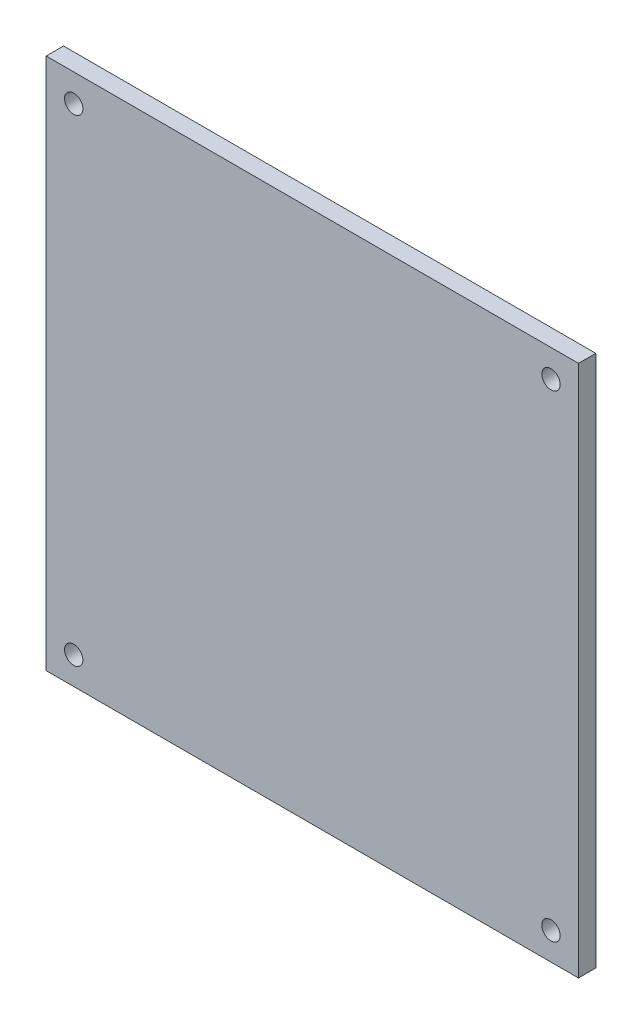
ISO-10303-21;
HEADER;
FILE_DESCRIPTION(('STEP AP214'),'2;1');
FILE_NAME('part.step','',(''),(''),'','','');
FILE_SCHEMA(('AUTOMOTIVE_DESIGN { 1 0 10303 214 1 1 1 1 }'));
ENDSEC;
DATA;
#1=APPLICATION_CONTEXT('core data for automotive mechanical design processes');
#2=APPLICATION_PROTOCOL_DEFINITION('international standard','automotive_design',2000,#1);
#3=PRODUCT_CONTEXT('',#1,'mechanical');
#4=PRODUCT('Part','Part','',(#3));
#5=PRODUCT_RELATED_PRODUCT_CATEGORY('part','',(#4));
#6=PRODUCT_DEFINITION_FORMATION('','',#4);
#7=PRODUCT_DEFINITION_CONTEXT('part definition',#1,'design');
#8=PRODUCT_DEFINITION('design','',#6,#7);
#9=PRODUCT_DEFINITION_SHAPE('','',#8);
#10=(LENGTH_UNIT() NAMED_UNIT(*) SI_UNIT(.MILLI.,.METRE.));
#11=(NAMED_UNIT(*) PLANE_ANGLE_UNIT() SI_UNIT($,.RADIAN.));
#12=(NAMED_UNIT(*) SI_UNIT($,.STERADIAN.) SOLID_ANGLE_UNIT());
#13=UNCERTAINTY_MEASURE_WITH_UNIT(LENGTH_MEASURE(1.E-05),#10,'distance_accuracy_value','');
#14=(GEOMETRIC_REPRESENTATION_CONTEXT(3) GLOBAL_UNCERTAINTY_ASSIGNED_CONTEXT((#13)) GLOBAL_UNIT_ASSIGNED_CONTEXT((#10,
#11,#12)) REPRESENTATION_CONTEXT('',''));
#15=CARTESIAN_POINT('',(0.,0.,0.));
#16=DIRECTION('',(0.,0.,1.));
#17=DIRECTION('',(1.,0.,0.));
#18=AXIS2_PLACEMENT_3D('',#15,#16,#17);
#19=CARTESIAN_POINT('',(0.,0.,5.9944));
#20=DIRECTION('',(0.,0.,-1.));
#21=DIRECTION('',(-1.,0.,0.));
#22=AXIS2_PLACEMENT_3D('',#19,#20,#21);
#23=PLANE('',#22);
#24=CARTESIAN_POINT('',(174.625,174.625,5.9944));
#25=DIRECTION('',(0.,0.,1.));
#26=DIRECTION('',(1.,0.,0.));
#27=AXIS2_PLACEMENT_3D('',#24,#25,#26);
#28=CIRCLE('',#27,3.175);
#29=CARTESIAN_POINT('',(177.8,174.625,5.9944));
#30=VERTEX_POINT('',#29);
#31=EDGE_CURVE('E120',#30,#30,#28,.T.);
#32=ORIENTED_EDGE('',*,*,#31,.F.);
#33=EDGE_LOOP('',(#32));
#34=FACE_BOUND('',#33,.T.);
#35=CARTESIAN_POINT('',(9.52500000000001,174.625,5.9944));
#36=DIRECTION('',(0.,0.,1.));
#37=DIRECTION('',(1.,0.,0.));
#38=AXIS2_PLACEMENT_3D('',#35,#36,#37);
#39=CIRCLE('',#38,3.175);
#40=CARTESIAN_POINT('',(12.7,174.625,5.9944));
#41=VERTEX_POINT('',#40);
#42=EDGE_CURVE('E99',#41,#41,#39,.T.);
#43=ORIENTED_EDGE('',*,*,#42,.F.);
#44=EDGE_LOOP('',(#43));
#45=FACE_BOUND('',#44,.T.);
#46=DIRECTION('',(0.,-1.,0.));
#47=VECTOR('',#46,1.);
#48=CARTESIAN_POINT('',(0.,0.,5.9944));
#49=LINE('',#48,#47);
#50=CARTESIAN_POINT('',(0.,184.15,5.9944));
#51=VERTEX_POINT('',#50);
#52=CARTESIAN_POINT('',(0.,0.,5.9944));
#53=VERTEX_POINT('',#52);
#54=EDGE_CURVE('E84',#51,#53,#49,.T.);
#55=ORIENTED_EDGE('',*,*,#54,.T.);
#56=DIRECTION('',(1.,0.,0.));
#57=VECTOR('',#56,1.);
#58=CARTESIAN_POINT('',(0.,0.,5.9944));
#59=LINE('',#58,#57);
#60=CARTESIAN_POINT('',(184.15,0.,5.9944));
#61=VERTEX_POINT('',#60);
#62=EDGE_CURVE('E79',#53,#61,#59,.T.);
#63=ORIENTED_EDGE('',*,*,#62,.T.);
#64=DIRECTION('',(0.,1.,0.));
#65=VECTOR('',#64,1.);
#66=CARTESIAN_POINT('',(184.15,0.,5.9944));
#67=LINE('',#66,#65);
#68=CARTESIAN_POINT('',(184.15,184.15,5.9944));
#69=VERTEX_POINT('',#68);
#70=EDGE_CURVE('E82',#61,#69,#67,.T.);
#71=ORIENTED_EDGE('',*,*,#70,.T.);
#72=DIRECTION('',(-1.,0.,0.));
#73=VECTOR('',#72,1.);
#74=CARTESIAN_POINT('',(0.,184.15,5.9944));
#75=LINE('',#74,#73);
#76=EDGE_CURVE('E49',#69,#51,#75,.T.);
#77=ORIENTED_EDGE('',*,*,#76,.T.);
#78=EDGE_LOOP('',(#55,#63,#71,#77));
#79=FACE_BOUND('',#78,.T.);
#80=CARTESIAN_POINT('',(9.52500000000001,9.52500000000001,5.9944));
#81=DIRECTION('',(0.,0.,1.));
#82=DIRECTION('',(1.,0.,0.));
#83=AXIS2_PLACEMENT_3D('',#80,#81,#82);
#84=CIRCLE('',#83,3.175);
#85=CARTESIAN_POINT('',(12.7,9.52500000000001,5.9944));
#86=VERTEX_POINT('',#85);
#87=EDGE_CURVE('E114',#86,#86,#84,.T.);
#88=ORIENTED_EDGE('',*,*,#87,.F.);
#89=EDGE_LOOP('',(#88));
#90=FACE_BOUND('',#89,.T.);
#91=CARTESIAN_POINT('',(174.625,9.52500000000001,5.9944));
#92=DIRECTION('',(0.,0.,1.));
#93=DIRECTION('',(1.,0.,0.));
#94=AXIS2_PLACEMENT_3D('',#91,#92,#93);
#95=CIRCLE('',#94,3.175);
#96=CARTESIAN_POINT('',(177.8,9.52500000000001,5.9944));
#97=VERTEX_POINT('',#96);
#98=EDGE_CURVE('E126',#97,#97,#95,.T.);
#99=ORIENTED_EDGE('',*,*,#98,.F.);
#100=EDGE_LOOP('',(#99));
#101=FACE_BOUND('',#100,.T.);
#102=ADVANCED_FACE('F32',(#34,#45,#79,#90,#101),#23,.F.);
#103=CARTESIAN_POINT('',(0.,0.,0.));
#104=DIRECTION('',(0.,0.,-1.));
#105=DIRECTION('',(-1.,0.,0.));
#106=AXIS2_PLACEMENT_3D('',#103,#104,#105);
#107=PLANE('',#106);
#108=CARTESIAN_POINT('',(174.625,174.625,0.));
#109=DIRECTION('',(0.,0.,1.));
#110=DIRECTION('',(1.,0.,0.));
#111=AXIS2_PLACEMENT_3D('',#108,#109,#110);
#112=CIRCLE('',#111,3.175);
#113=CARTESIAN_POINT('',(177.8,174.625,0.));
#114=VERTEX_POINT('',#113);
#115=EDGE_CURVE('E123',#114,#114,#112,.T.);
#116=ORIENTED_EDGE('',*,*,#115,.T.);
#117=EDGE_LOOP('',(#116));
#118=FACE_BOUND('',#117,.T.);
#119=CARTESIAN_POINT('',(9.52500000000001,174.625,0.));
#120=DIRECTION('',(0.,0.,1.));
#121=DIRECTION('',(1.,0.,0.));
#122=AXIS2_PLACEMENT_3D('',#119,#120,#121);
#123=CIRCLE('',#122,3.175);
#124=CARTESIAN_POINT('',(12.7,174.625,0.));
#125=VERTEX_POINT('',#124);
#126=EDGE_CURVE('E111',#125,#125,#123,.T.);
#127=ORIENTED_EDGE('',*,*,#126,.T.);
#128=EDGE_LOOP('',(#127));
#129=FACE_BOUND('',#128,.T.);
#130=DIRECTION('',(0.,-1.,0.));
#131=VECTOR('',#130,1.);
#132=CARTESIAN_POINT('',(0.,0.,0.));
#133=LINE('',#132,#131);
#134=CARTESIAN_POINT('',(0.,184.15,0.));
#135=VERTEX_POINT('',#134);
#136=CARTESIAN_POINT('',(0.,0.,0.));
#137=VERTEX_POINT('',#136);
#138=EDGE_CURVE('E96',#135,#137,#133,.T.);
#139=ORIENTED_EDGE('',*,*,#138,.F.);
#140=DIRECTION('',(-1.,0.,0.));
#141=VECTOR('',#140,1.);
#142=CARTESIAN_POINT('',(0.,184.15,0.));
#143=LINE('',#142,#141);
#144=CARTESIAN_POINT('',(184.15,184.15,0.));
#145=VERTEX_POINT('',#144);
#146=EDGE_CURVE('E72',#145,#135,#143,.T.);
#147=ORIENTED_EDGE('',*,*,#146,.F.);
#148=DIRECTION('',(0.,1.,0.));
#149=VECTOR('',#148,1.);
#150=CARTESIAN_POINT('',(184.15,0.,0.));
#151=LINE('',#150,#149);
#152=CARTESIAN_POINT('',(184.15,0.,0.));
#153=VERTEX_POINT('',#152);
#154=EDGE_CURVE('E66',#153,#145,#151,.T.);
#155=ORIENTED_EDGE('',*,*,#154,.F.);
#156=DIRECTION('',(1.,0.,0.));
#157=VECTOR('',#156,1.);
#158=CARTESIAN_POINT('',(0.,0.,0.));
#159=LINE('',#158,#157);
#160=EDGE_CURVE('E88',#137,#153,#159,.T.);
#161=ORIENTED_EDGE('',*,*,#160,.F.);
#162=EDGE_LOOP('',(#139,#147,#155,#161));
#163=FACE_BOUND('',#162,.T.);
#164=CARTESIAN_POINT('',(9.52500000000001,9.52500000000001,0.));
#165=DIRECTION('',(0.,0.,1.));
#166=DIRECTION('',(1.,0.,0.));
#167=AXIS2_PLACEMENT_3D('',#164,#165,#166);
#168=CIRCLE('',#167,3.175);
#169=CARTESIAN_POINT('',(12.7,9.52500000000001,0.));
#170=VERTEX_POINT('',#169);
#171=EDGE_CURVE('E117',#170,#170,#168,.T.);
#172=ORIENTED_EDGE('',*,*,#171,.T.);
#173=EDGE_LOOP('',(#172));
#174=FACE_BOUND('',#173,.T.);
#175=CARTESIAN_POINT('',(174.625,9.52500000000001,0.));
#176=DIRECTION('',(0.,0.,1.));
#177=DIRECTION('',(1.,0.,0.));
#178=AXIS2_PLACEMENT_3D('',#175,#176,#177);
#179=CIRCLE('',#178,3.175);
#180=CARTESIAN_POINT('',(177.8,9.52500000000001,0.));
#181=VERTEX_POINT('',#180);
#182=EDGE_CURVE('E129',#181,#181,#179,.T.);
#183=ORIENTED_EDGE('',*,*,#182,.T.);
#184=EDGE_LOOP('',(#183));
#185=FACE_BOUND('',#184,.T.);
#186=ADVANCED_FACE('F107',(#118,#129,#163,#174,#185),#107,.T.);
#187=CARTESIAN_POINT('',(0.,0.,5.9944));
#188=DIRECTION('',(1.,0.,0.));
#189=DIRECTION('',(0.,0.,-1.));
#190=AXIS2_PLACEMENT_3D('',#187,#188,#189);
#191=PLANE('',#190);
#192=ORIENTED_EDGE('',*,*,#138,.T.);
#193=DIRECTION('',(0.,0.,-1.));
#194=VECTOR('',#193,1.);
#195=CARTESIAN_POINT('',(0.,0.,5.9944));
#196=LINE('',#195,#194);
#197=EDGE_CURVE('E11',#53,#137,#196,.T.);
#198=ORIENTED_EDGE('',*,*,#197,.F.);
#199=ORIENTED_EDGE('',*,*,#54,.F.);
#200=DIRECTION('',(0.,0.,-1.));
#201=VECTOR('',#200,1.);
#202=CARTESIAN_POINT('',(0.,184.15,5.9944));
#203=LINE('',#202,#201);
#204=EDGE_CURVE('E92',#51,#135,#203,.T.);
#205=ORIENTED_EDGE('',*,*,#204,.T.);
#206=EDGE_LOOP('',(#192,#198,#199,#205));
#207=FACE_BOUND('',#206,.T.);
#208=ADVANCED_FACE('F34',(#207),#191,.F.);
#209=CARTESIAN_POINT('',(0.,0.,5.9944));
#210=DIRECTION('',(0.,1.,0.));
#211=DIRECTION('',(0.,0.,1.));
#212=AXIS2_PLACEMENT_3D('',#209,#210,#211);
#213=PLANE('',#212);
#214=ORIENTED_EDGE('',*,*,#160,.T.);
#215=DIRECTION('',(0.,0.,-1.));
#216=VECTOR('',#215,1.);
#217=CARTESIAN_POINT('',(184.15,0.,5.9944));
#218=LINE('',#217,#216);
#219=EDGE_CURVE('E41',#61,#153,#218,.T.);
#220=ORIENTED_EDGE('',*,*,#219,.F.);
#221=ORIENTED_EDGE('',*,*,#62,.F.);
#222=ORIENTED_EDGE('',*,*,#197,.T.);
#223=EDGE_LOOP('',(#214,#220,#221,#222));
#224=FACE_BOUND('',#223,.T.);
#225=ADVANCED_FACE('F87',(#224),#213,.F.);
#226=CARTESIAN_POINT('',(184.15,0.,5.9944));
#227=DIRECTION('',(-1.,0.,0.));
#228=DIRECTION('',(0.,0.,1.));
#229=AXIS2_PLACEMENT_3D('',#226,#227,#228);
#230=PLANE('',#229);
#231=ORIENTED_EDGE('',*,*,#154,.T.);
#232=DIRECTION('',(0.,0.,-1.));
#233=VECTOR('',#232,1.);
#234=CARTESIAN_POINT('',(184.15,184.15,5.9944));
#235=LINE('',#234,#233);
#236=EDGE_CURVE('E89',#69,#145,#235,.T.);
#237=ORIENTED_EDGE('',*,*,#236,.F.);
#238=ORIENTED_EDGE('',*,*,#70,.F.);
#239=ORIENTED_EDGE('',*,*,#219,.T.);
#240=EDGE_LOOP('',(#231,#237,#238,#239));
#241=FACE_BOUND('',#240,.T.);
#242=ADVANCED_FACE('F90',(#241),#230,.F.);
#243=CARTESIAN_POINT('',(0.,184.15,5.9944));
#244=DIRECTION('',(0.,-1.,0.));
#245=DIRECTION('',(0.,0.,-1.));
#246=AXIS2_PLACEMENT_3D('',#243,#244,#245);
#247=PLANE('',#246);
#248=ORIENTED_EDGE('',*,*,#146,.T.);
#249=ORIENTED_EDGE('',*,*,#204,.F.);
#250=ORIENTED_EDGE('',*,*,#76,.F.);
#251=ORIENTED_EDGE('',*,*,#236,.T.);
#252=EDGE_LOOP('',(#248,#249,#250,#251));
#253=FACE_BOUND('',#252,.T.);
#254=ADVANCED_FACE('F104',(#253),#247,.F.);
#255=CARTESIAN_POINT('',(9.52500000000001,174.625,5.9944));
#256=DIRECTION('',(0.,0.,-1.));
#257=DIRECTION('',(-1.,0.,0.));
#258=AXIS2_PLACEMENT_3D('',#255,#256,#257);
#259=CYLINDRICAL_SURFACE('',#258,3.175);
#260=ORIENTED_EDGE('',*,*,#42,.T.);
#261=EDGE_LOOP('',(#260));
#262=FACE_BOUND('',#261,.T.);
#263=ORIENTED_EDGE('',*,*,#126,.F.);
#264=EDGE_LOOP('',(#263));
#265=FACE_BOUND('',#264,.T.);
#266=ADVANCED_FACE('F149',(#262,#265),#259,.F.);
#267=CARTESIAN_POINT('',(9.52500000000001,9.52500000000001,5.9944));
#268=DIRECTION('',(0.,0.,-1.));
#269=DIRECTION('',(-1.,0.,0.));
#270=AXIS2_PLACEMENT_3D('',#267,#268,#269);
#271=CYLINDRICAL_SURFACE('',#270,3.175);
#272=ORIENTED_EDGE('',*,*,#87,.T.);
#273=EDGE_LOOP('',(#272));
#274=FACE_BOUND('',#273,.T.);
#275=ORIENTED_EDGE('',*,*,#171,.F.);
#276=EDGE_LOOP('',(#275));
#277=FACE_BOUND('',#276,.T.);
#278=ADVANCED_FACE('F195',(#274,#277),#271,.F.);
#279=CARTESIAN_POINT('',(174.625,174.625,5.9944));
#280=DIRECTION('',(0.,0.,-1.));
#281=DIRECTION('',(-1.,0.,0.));
#282=AXIS2_PLACEMENT_3D('',#279,#280,#281);
#283=CYLINDRICAL_SURFACE('',#282,3.175);
#284=ORIENTED_EDGE('',*,*,#31,.T.);
#285=EDGE_LOOP('',(#284));
#286=FACE_BOUND('',#285,.T.);
#287=ORIENTED_EDGE('',*,*,#115,.F.);
#288=EDGE_LOOP('',(#287));
#289=FACE_BOUND('',#288,.T.);
#290=ADVANCED_FACE('F203',(#286,#289),#283,.F.);
#291=CARTESIAN_POINT('',(174.625,9.52500000000001,5.9944));
#292=DIRECTION('',(0.,0.,-1.));
#293=DIRECTION('',(-1.,0.,0.));
#294=AXIS2_PLACEMENT_3D('',#291,#292,#293);
#295=CYLINDRICAL_SURFACE('',#294,3.175);
#296=ORIENTED_EDGE('',*,*,#98,.T.);
#297=EDGE_LOOP('',(#296));
#298=FACE_BOUND('',#297,.T.);
#299=ORIENTED_EDGE('',*,*,#182,.F.);
#300=EDGE_LOOP('',(#299));
#301=FACE_BOUND('',#300,.T.);
#302=ADVANCED_FACE('F135',(#298,#301),#295,.F.);
#303=CLOSED_SHELL('',(#102,#186,#208,#225,#242,#254,#266,#278,#290,#302));
#304=MANIFOLD_SOLID_BREP('B2',#303);
#305=ADVANCED_BREP_SHAPE_REPRESENTATION('',(#18,#304),#14);
#306=SHAPE_DEFINITION_REPRESENTATION(#9,#305);
ENDSEC;
END-ISO-10303-21;
